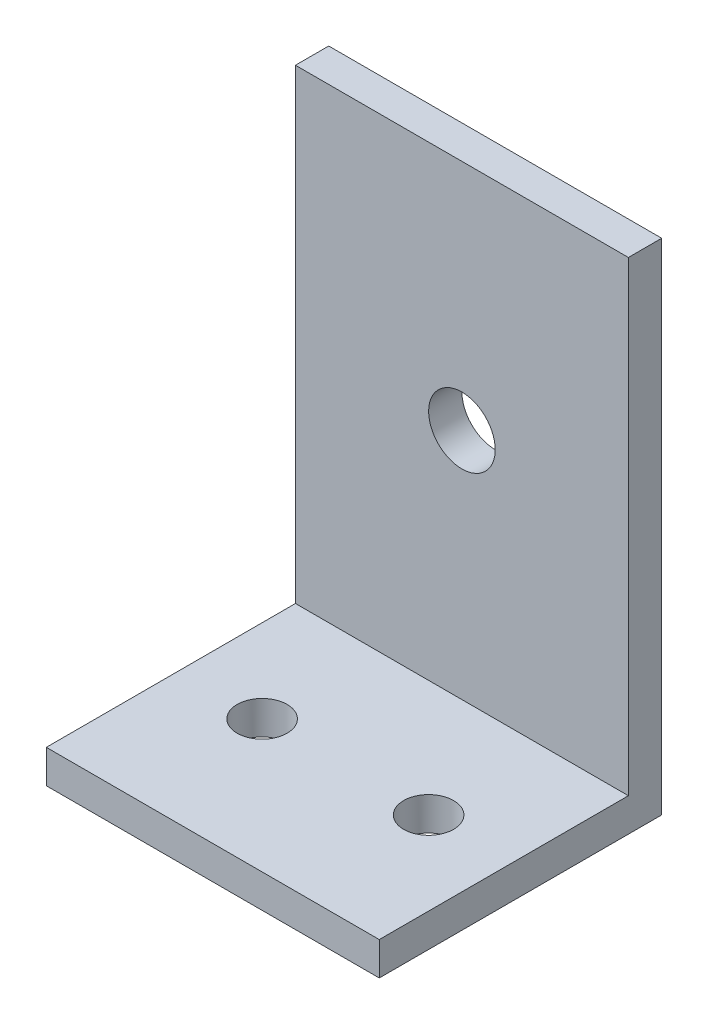
ISO-10303-21;
HEADER;
FILE_DESCRIPTION(('STEP AP214'),'2;1');
FILE_NAME('part.step','',(''),(''),'','','');
FILE_SCHEMA(('AUTOMOTIVE_DESIGN { 1 0 10303 214 1 1 1 1 }'));
ENDSEC;
DATA;
#1=APPLICATION_CONTEXT('core data for automotive mechanical design processes');
#2=APPLICATION_PROTOCOL_DEFINITION('international standard','automotive_design',2000,#1);
#3=PRODUCT_CONTEXT('',#1,'mechanical');
#4=PRODUCT('Part','Part','',(#3));
#5=PRODUCT_RELATED_PRODUCT_CATEGORY('part','',(#4));
#6=PRODUCT_DEFINITION_FORMATION('','',#4);
#7=PRODUCT_DEFINITION_CONTEXT('part definition',#1,'design');
#8=PRODUCT_DEFINITION('design','',#6,#7);
#9=PRODUCT_DEFINITION_SHAPE('','',#8);
#10=(LENGTH_UNIT() NAMED_UNIT(*) SI_UNIT(.MILLI.,.METRE.));
#11=(NAMED_UNIT(*) PLANE_ANGLE_UNIT() SI_UNIT($,.RADIAN.));
#12=(NAMED_UNIT(*) SI_UNIT($,.STERADIAN.) SOLID_ANGLE_UNIT());
#13=UNCERTAINTY_MEASURE_WITH_UNIT(LENGTH_MEASURE(1.E-05),#10,'distance_accuracy_value','');
#14=(GEOMETRIC_REPRESENTATION_CONTEXT(3) GLOBAL_UNCERTAINTY_ASSIGNED_CONTEXT((#13)) GLOBAL_UNIT_ASSIGNED_CONTEXT((#10,
#11,#12)) REPRESENTATION_CONTEXT('',''));
#15=CARTESIAN_POINT('',(0.,0.,0.));
#16=DIRECTION('',(0.,0.,1.));
#17=DIRECTION('',(1.,0.,0.));
#18=AXIS2_PLACEMENT_3D('',#15,#16,#17);
#19=CARTESIAN_POINT('',(30.,35.,-3.));
#20=DIRECTION('',(0.,0.,1.));
#21=DIRECTION('',(0.,-1.,0.));
#22=AXIS2_PLACEMENT_3D('',#19,#20,#21);
#23=PLANE('',#22);
#24=CARTESIAN_POINT('',(20.0000000000073,13.0000000000013,-3.));
#25=DIRECTION('',(0.,0.,-1.));
#26=DIRECTION('',(0.,1.,0.));
#27=AXIS2_PLACEMENT_3D('',#24,#25,#26);
#28=CIRCLE('',#27,2.);
#29=CARTESIAN_POINT('',(20.0000000000073,15.0000000000013,-3.));
#30=VERTEX_POINT('',#29);
#31=EDGE_CURVE('E179',#30,#30,#28,.T.);
#32=ORIENTED_EDGE('',*,*,#31,.F.);
#33=EDGE_LOOP('',(#32));
#34=FACE_BOUND('',#33,.T.);
#35=DIRECTION('',(0.,-1.,0.));
#36=VECTOR('',#35,1.);
#37=CARTESIAN_POINT('',(10.,35.,-3.));
#38=LINE('',#37,#36);
#39=CARTESIAN_POINT('',(10.,27.,-3.));
#40=VERTEX_POINT('',#39);
#41=CARTESIAN_POINT('',(10.,-3.,-3.));
#42=VERTEX_POINT('',#41);
#43=EDGE_CURVE('E134',#40,#42,#38,.T.);
#44=ORIENTED_EDGE('',*,*,#43,.F.);
#45=DIRECTION('',(-1.,0.,0.));
#46=VECTOR('',#45,1.);
#47=CARTESIAN_POINT('',(10.,27.,-3.));
#48=LINE('',#47,#46);
#49=CARTESIAN_POINT('',(30.,27.,-3.));
#50=VERTEX_POINT('',#49);
#51=EDGE_CURVE('E104',#50,#40,#48,.T.);
#52=ORIENTED_EDGE('',*,*,#51,.F.);
#53=DIRECTION('',(0.,1.,0.));
#54=VECTOR('',#53,1.);
#55=CARTESIAN_POINT('',(30.,35.,-3.));
#56=LINE('',#55,#54);
#57=CARTESIAN_POINT('',(30.,-3.,-3.));
#58=VERTEX_POINT('',#57);
#59=EDGE_CURVE('E44',#58,#50,#56,.T.);
#60=ORIENTED_EDGE('',*,*,#59,.F.);
#61=DIRECTION('',(-1.,0.,0.));
#62=VECTOR('',#61,1.);
#63=CARTESIAN_POINT('',(30.,-3.,-3.));
#64=LINE('',#63,#62);
#65=EDGE_CURVE('E11',#58,#42,#64,.T.);
#66=ORIENTED_EDGE('',*,*,#65,.T.);
#67=EDGE_LOOP('',(#44,#52,#60,#66));
#68=FACE_BOUND('',#67,.T.);
#69=ADVANCED_FACE('F35',(#34,#68),#23,.F.);
#70=CARTESIAN_POINT('',(30.,-3.,35.));
#71=DIRECTION('',(0.,1.,0.));
#72=DIRECTION('',(0.,0.,1.));
#73=AXIS2_PLACEMENT_3D('',#70,#71,#72);
#74=PLANE('',#73);
#75=CARTESIAN_POINT('',(15.,-3.,6.));
#76=DIRECTION('',(0.,1.,0.));
#77=DIRECTION('',(0.,0.,1.));
#78=AXIS2_PLACEMENT_3D('',#75,#76,#77);
#79=CIRCLE('',#78,1.5);
#80=CARTESIAN_POINT('',(15.,-3.,7.5));
#81=VERTEX_POINT('',#80);
#82=EDGE_CURVE('E128',#81,#81,#79,.T.);
#83=ORIENTED_EDGE('',*,*,#82,.T.);
#84=EDGE_LOOP('',(#83));
#85=FACE_BOUND('',#84,.T.);
#86=CARTESIAN_POINT('',(25.,-3.,6.));
#87=DIRECTION('',(0.,1.,0.));
#88=DIRECTION('',(0.,0.,1.));
#89=AXIS2_PLACEMENT_3D('',#86,#87,#88);
#90=CIRCLE('',#89,1.5);
#91=CARTESIAN_POINT('',(25.,-3.,7.5));
#92=VERTEX_POINT('',#91);
#93=EDGE_CURVE('E123',#92,#92,#90,.T.);
#94=ORIENTED_EDGE('',*,*,#93,.T.);
#95=EDGE_LOOP('',(#94));
#96=FACE_BOUND('',#95,.T.);
#97=DIRECTION('',(0.,0.,-1.));
#98=VECTOR('',#97,1.);
#99=CARTESIAN_POINT('',(30.,-3.,35.));
#100=LINE('',#99,#98);
#101=CARTESIAN_POINT('',(30.,-3.,13.9641374907455));
#102=VERTEX_POINT('',#101);
#103=EDGE_CURVE('E139',#102,#58,#100,.T.);
#104=ORIENTED_EDGE('',*,*,#103,.F.);
#105=DIRECTION('',(-1.,0.,0.));
#106=VECTOR('',#105,1.);
#107=CARTESIAN_POINT('',(30.,-3.,13.9641374907455));
#108=LINE('',#107,#106);
#109=CARTESIAN_POINT('',(10.,-3.,13.9641374907455));
#110=VERTEX_POINT('',#109);
#111=EDGE_CURVE('E127',#102,#110,#108,.T.);
#112=ORIENTED_EDGE('',*,*,#111,.T.);
#113=DIRECTION('',(0.,0.,1.));
#114=VECTOR('',#113,1.);
#115=CARTESIAN_POINT('',(10.,-3.,35.));
#116=LINE('',#115,#114);
#117=EDGE_CURVE('E136',#42,#110,#116,.T.);
#118=ORIENTED_EDGE('',*,*,#117,.F.);
#119=ORIENTED_EDGE('',*,*,#65,.F.);
#120=EDGE_LOOP('',(#104,#112,#118,#119));
#121=FACE_BOUND('',#120,.T.);
#122=ADVANCED_FACE('F37',(#85,#96,#121),#74,.F.);
#123=CARTESIAN_POINT('',(30.,0.,0.));
#124=DIRECTION('',(1.,0.,0.));
#125=DIRECTION('',(0.,0.,-1.));
#126=AXIS2_PLACEMENT_3D('',#123,#124,#125);
#127=PLANE('',#126);
#128=DIRECTION('',(0.,0.,-1.));
#129=VECTOR('',#128,1.);
#130=CARTESIAN_POINT('',(30.,27.,-1.));
#131=LINE('',#130,#129);
#132=CARTESIAN_POINT('',(30.,27.,-1.));
#133=VERTEX_POINT('',#132);
#134=EDGE_CURVE('E91',#133,#50,#131,.T.);
#135=ORIENTED_EDGE('',*,*,#134,.F.);
#136=DIRECTION('',(0.,1.,0.));
#137=VECTOR('',#136,1.);
#138=CARTESIAN_POINT('',(30.,-1.,-1.));
#139=LINE('',#138,#137);
#140=CARTESIAN_POINT('',(30.,-1.,-1.));
#141=VERTEX_POINT('',#140);
#142=EDGE_CURVE('E102',#141,#133,#139,.T.);
#143=ORIENTED_EDGE('',*,*,#142,.F.);
#144=DIRECTION('',(0.,0.,-1.));
#145=VECTOR('',#144,1.);
#146=CARTESIAN_POINT('',(30.,-1.,13.9641374907455));
#147=LINE('',#146,#145);
#148=CARTESIAN_POINT('',(30.,-1.,13.9641374907455));
#149=VERTEX_POINT('',#148);
#150=EDGE_CURVE('E117',#149,#141,#147,.T.);
#151=ORIENTED_EDGE('',*,*,#150,.F.);
#152=DIRECTION('',(0.,1.,0.));
#153=VECTOR('',#152,1.);
#154=CARTESIAN_POINT('',(30.,-10.,13.9641374907455));
#155=LINE('',#154,#153);
#156=EDGE_CURVE('E124',#102,#149,#155,.T.);
#157=ORIENTED_EDGE('',*,*,#156,.F.);
#158=ORIENTED_EDGE('',*,*,#103,.T.);
#159=ORIENTED_EDGE('',*,*,#59,.T.);
#160=EDGE_LOOP('',(#135,#143,#151,#157,#158,#159));
#161=FACE_BOUND('',#160,.T.);
#162=ADVANCED_FACE('F100',(#161),#127,.T.);
#163=CARTESIAN_POINT('',(10.,0.,0.));
#164=DIRECTION('',(-1.,0.,0.));
#165=DIRECTION('',(0.,0.,1.));
#166=AXIS2_PLACEMENT_3D('',#163,#164,#165);
#167=PLANE('',#166);
#168=DIRECTION('',(0.,0.,1.));
#169=VECTOR('',#168,1.);
#170=CARTESIAN_POINT('',(10.,27.,-1.));
#171=LINE('',#170,#169);
#172=CARTESIAN_POINT('',(10.,27.,-1.));
#173=VERTEX_POINT('',#172);
#174=EDGE_CURVE('E52',#40,#173,#171,.T.);
#175=ORIENTED_EDGE('',*,*,#174,.F.);
#176=ORIENTED_EDGE('',*,*,#43,.T.);
#177=ORIENTED_EDGE('',*,*,#117,.T.);
#178=DIRECTION('',(0.,1.,0.));
#179=VECTOR('',#178,1.);
#180=CARTESIAN_POINT('',(10.,-6.02031750588594,13.9641374907455));
#181=LINE('',#180,#179);
#182=CARTESIAN_POINT('',(10.,-0.999999999999999,13.9641374907455));
#183=VERTEX_POINT('',#182);
#184=EDGE_CURVE('E131',#110,#183,#181,.T.);
#185=ORIENTED_EDGE('',*,*,#184,.T.);
#186=DIRECTION('',(0.,0.,1.));
#187=VECTOR('',#186,1.);
#188=CARTESIAN_POINT('',(10.,-1.,13.9641374907455));
#189=LINE('',#188,#187);
#190=CARTESIAN_POINT('',(10.,-1.,-1.));
#191=VERTEX_POINT('',#190);
#192=EDGE_CURVE('E60',#191,#183,#189,.T.);
#193=ORIENTED_EDGE('',*,*,#192,.F.);
#194=DIRECTION('',(0.,-1.,0.));
#195=VECTOR('',#194,1.);
#196=CARTESIAN_POINT('',(10.,-1.,-1.));
#197=LINE('',#196,#195);
#198=EDGE_CURVE('E112',#173,#191,#197,.T.);
#199=ORIENTED_EDGE('',*,*,#198,.F.);
#200=EDGE_LOOP('',(#175,#176,#177,#185,#193,#199));
#201=FACE_BOUND('',#200,.T.);
#202=ADVANCED_FACE('F173',(#201),#167,.T.);
#203=CARTESIAN_POINT('',(0.,-10.,13.9641374907455));
#204=DIRECTION('',(0.,0.,-1.));
#205=DIRECTION('',(-1.,0.,0.));
#206=AXIS2_PLACEMENT_3D('',#203,#204,#205);
#207=PLANE('',#206);
#208=ORIENTED_EDGE('',*,*,#156,.T.);
#209=DIRECTION('',(1.,0.,0.));
#210=VECTOR('',#209,1.);
#211=CARTESIAN_POINT('',(10.,-1.,13.9641374907455));
#212=LINE('',#211,#210);
#213=EDGE_CURVE('E110',#183,#149,#212,.T.);
#214=ORIENTED_EDGE('',*,*,#213,.F.);
#215=ORIENTED_EDGE('',*,*,#184,.F.);
#216=ORIENTED_EDGE('',*,*,#111,.F.);
#217=EDGE_LOOP('',(#208,#214,#215,#216));
#218=FACE_BOUND('',#217,.T.);
#219=ADVANCED_FACE('F160',(#218),#207,.F.);
#220=CARTESIAN_POINT('',(25.,-10.,6.));
#221=DIRECTION('',(0.,1.,0.));
#222=DIRECTION('',(0.,0.,1.));
#223=AXIS2_PLACEMENT_3D('',#220,#221,#222);
#224=CYLINDRICAL_SURFACE('',#223,1.5);
#225=CARTESIAN_POINT('',(25.,-0.999999999999999,6.));
#226=DIRECTION('',(0.,-1.,0.));
#227=DIRECTION('',(0.,0.,-1.));
#228=AXIS2_PLACEMENT_3D('',#225,#226,#227);
#229=CIRCLE('',#228,1.5);
#230=CARTESIAN_POINT('',(25.,-0.999999999999999,4.5));
#231=VERTEX_POINT('',#230);
#232=EDGE_CURVE('E120',#231,#231,#229,.F.);
#233=ORIENTED_EDGE('',*,*,#232,.T.);
#234=EDGE_LOOP('',(#233));
#235=FACE_BOUND('',#234,.T.);
#236=ORIENTED_EDGE('',*,*,#93,.F.);
#237=EDGE_LOOP('',(#236));
#238=FACE_BOUND('',#237,.T.);
#239=ADVANCED_FACE('F157',(#235,#238),#224,.F.);
#240=CARTESIAN_POINT('',(15.,-10.,6.));
#241=DIRECTION('',(0.,1.,0.));
#242=DIRECTION('',(0.,0.,1.));
#243=AXIS2_PLACEMENT_3D('',#240,#241,#242);
#244=CYLINDRICAL_SURFACE('',#243,1.5);
#245=CARTESIAN_POINT('',(15.,-0.999999999999999,6.));
#246=DIRECTION('',(0.,-1.,0.));
#247=DIRECTION('',(0.,0.,-1.));
#248=AXIS2_PLACEMENT_3D('',#245,#246,#247);
#249=CIRCLE('',#248,1.5);
#250=CARTESIAN_POINT('',(15.,-0.999999999999999,4.5));
#251=VERTEX_POINT('',#250);
#252=EDGE_CURVE('E119',#251,#251,#249,.F.);
#253=ORIENTED_EDGE('',*,*,#252,.T.);
#254=EDGE_LOOP('',(#253));
#255=FACE_BOUND('',#254,.T.);
#256=ORIENTED_EDGE('',*,*,#82,.F.);
#257=EDGE_LOOP('',(#256));
#258=FACE_BOUND('',#257,.T.);
#259=ADVANCED_FACE('F148',(#255,#258),#244,.F.);
#260=CARTESIAN_POINT('',(0.,-1.,0.));
#261=DIRECTION('',(0.,-1.,0.));
#262=DIRECTION('',(0.,0.,-1.));
#263=AXIS2_PLACEMENT_3D('',#260,#261,#262);
#264=PLANE('',#263);
#265=ORIENTED_EDGE('',*,*,#252,.F.);
#266=EDGE_LOOP('',(#265));
#267=FACE_BOUND('',#266,.T.);
#268=ORIENTED_EDGE('',*,*,#192,.T.);
#269=ORIENTED_EDGE('',*,*,#213,.T.);
#270=ORIENTED_EDGE('',*,*,#150,.T.);
#271=DIRECTION('',(1.,0.,0.));
#272=VECTOR('',#271,1.);
#273=CARTESIAN_POINT('',(10.,-1.,-1.));
#274=LINE('',#273,#272);
#275=EDGE_CURVE('E108',#191,#141,#274,.T.);
#276=ORIENTED_EDGE('',*,*,#275,.F.);
#277=EDGE_LOOP('',(#268,#269,#270,#276));
#278=FACE_BOUND('',#277,.T.);
#279=ORIENTED_EDGE('',*,*,#232,.F.);
#280=EDGE_LOOP('',(#279));
#281=FACE_BOUND('',#280,.T.);
#282=ADVANCED_FACE('F151',(#267,#278,#281),#264,.F.);
#283=CARTESIAN_POINT('',(0.,0.,-1.));
#284=DIRECTION('',(0.,0.,-1.));
#285=DIRECTION('',(-1.,0.,0.));
#286=AXIS2_PLACEMENT_3D('',#283,#284,#285);
#287=PLANE('',#286);
#288=CARTESIAN_POINT('',(20.0000000000073,13.0000000000013,-1.));
#289=DIRECTION('',(0.,0.,-1.));
#290=DIRECTION('',(-1.,0.,0.));
#291=AXIS2_PLACEMENT_3D('',#288,#289,#290);
#292=CIRCLE('',#291,2.);
#293=CARTESIAN_POINT('',(18.0000000000073,13.0000000000013,-1.));
#294=VERTEX_POINT('',#293);
#295=EDGE_CURVE('E39',#294,#294,#292,.T.);
#296=ORIENTED_EDGE('',*,*,#295,.T.);
#297=EDGE_LOOP('',(#296));
#298=FACE_BOUND('',#297,.T.);
#299=ORIENTED_EDGE('',*,*,#142,.T.);
#300=DIRECTION('',(1.,0.,0.));
#301=VECTOR('',#300,1.);
#302=CARTESIAN_POINT('',(10.,27.,-1.));
#303=LINE('',#302,#301);
#304=EDGE_CURVE('E88',#173,#133,#303,.T.);
#305=ORIENTED_EDGE('',*,*,#304,.F.);
#306=ORIENTED_EDGE('',*,*,#198,.T.);
#307=ORIENTED_EDGE('',*,*,#275,.T.);
#308=EDGE_LOOP('',(#299,#305,#306,#307));
#309=FACE_BOUND('',#308,.T.);
#310=ADVANCED_FACE('F107',(#298,#309),#287,.F.);
#311=CARTESIAN_POINT('',(0.,27.,0.));
#312=DIRECTION('',(0.,-1.,0.));
#313=DIRECTION('',(0.,0.,-1.));
#314=AXIS2_PLACEMENT_3D('',#311,#312,#313);
#315=PLANE('',#314);
#316=ORIENTED_EDGE('',*,*,#174,.T.);
#317=ORIENTED_EDGE('',*,*,#304,.T.);
#318=ORIENTED_EDGE('',*,*,#134,.T.);
#319=ORIENTED_EDGE('',*,*,#51,.T.);
#320=EDGE_LOOP('',(#316,#317,#318,#319));
#321=FACE_BOUND('',#320,.T.);
#322=ADVANCED_FACE('F90',(#321),#315,.F.);
#323=CARTESIAN_POINT('',(20.0000000000073,13.0000000000013,5.));
#324=DIRECTION('',(0.,0.,-1.));
#325=DIRECTION('',(0.,1.,0.));
#326=AXIS2_PLACEMENT_3D('',#323,#324,#325);
#327=CYLINDRICAL_SURFACE('',#326,2.);
#328=ORIENTED_EDGE('',*,*,#31,.T.);
#329=EDGE_LOOP('',(#328));
#330=FACE_BOUND('',#329,.T.);
#331=ORIENTED_EDGE('',*,*,#295,.F.);
#332=EDGE_LOOP('',(#331));
#333=FACE_BOUND('',#332,.T.);
#334=ADVANCED_FACE('F187',(#330,#333),#327,.F.);
#335=CLOSED_SHELL('',(#69,#122,#162,#202,#219,#239,#259,#282,#310,#322,#334));
#336=MANIFOLD_SOLID_BREP('B2',#335);
#337=ADVANCED_BREP_SHAPE_REPRESENTATION('',(#18,#336),#14);
#338=SHAPE_DEFINITION_REPRESENTATION(#9,#337);
ENDSEC;
END-ISO-10303-21;
